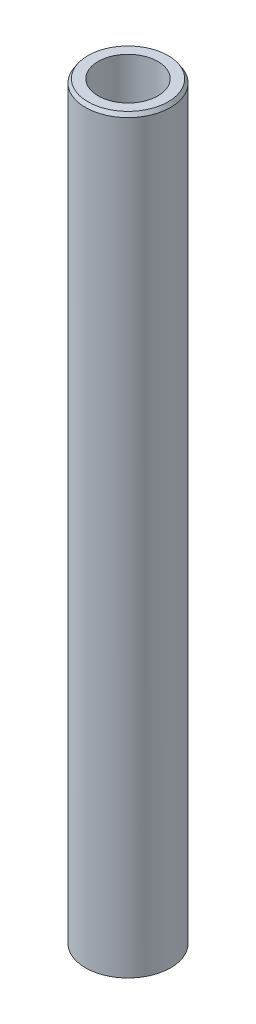
ISO-10303-21;
HEADER;
FILE_DESCRIPTION(('STEP AP214'),'2;1');
FILE_NAME('part.step','',(''),(''),'','','');
FILE_SCHEMA(('AUTOMOTIVE_DESIGN { 1 0 10303 214 1 1 1 1 }'));
ENDSEC;
DATA;
#1=APPLICATION_CONTEXT('core data for automotive mechanical design processes');
#2=APPLICATION_PROTOCOL_DEFINITION('international standard','automotive_design',2000,#1);
#3=PRODUCT_CONTEXT('',#1,'mechanical');
#4=PRODUCT('Part','Part','',(#3));
#5=PRODUCT_RELATED_PRODUCT_CATEGORY('part','',(#4));
#6=PRODUCT_DEFINITION_FORMATION('','',#4);
#7=PRODUCT_DEFINITION_CONTEXT('part definition',#1,'design');
#8=PRODUCT_DEFINITION('design','',#6,#7);
#9=PRODUCT_DEFINITION_SHAPE('','',#8);
#10=(LENGTH_UNIT() NAMED_UNIT(*) SI_UNIT(.MILLI.,.METRE.));
#11=(NAMED_UNIT(*) PLANE_ANGLE_UNIT() SI_UNIT($,.RADIAN.));
#12=(NAMED_UNIT(*) SI_UNIT($,.STERADIAN.) SOLID_ANGLE_UNIT());
#13=UNCERTAINTY_MEASURE_WITH_UNIT(LENGTH_MEASURE(1.E-05),#10,'distance_accuracy_value','');
#14=(GEOMETRIC_REPRESENTATION_CONTEXT(3) GLOBAL_UNCERTAINTY_ASSIGNED_CONTEXT((#13)) GLOBAL_UNIT_ASSIGNED_CONTEXT((#10,
#11,#12)) REPRESENTATION_CONTEXT('',''));
#15=CARTESIAN_POINT('',(0.,0.,0.));
#16=DIRECTION('',(0.,0.,1.));
#17=DIRECTION('',(1.,0.,0.));
#18=AXIS2_PLACEMENT_3D('',#15,#16,#17);
#19=CARTESIAN_POINT('',(0.,441.764951988883,0.));
#20=DIRECTION('',(0.,-1.,0.));
#21=DIRECTION('',(0.,0.,-1.));
#22=AXIS2_PLACEMENT_3D('',#19,#20,#21);
#23=CYLINDRICAL_SURFACE('',#22,25.);
#24=CARTESIAN_POINT('',(0.,439.59367557882,0.));
#25=DIRECTION('',(0.,1.,0.));
#26=DIRECTION('',(0.,0.,1.));
#27=AXIS2_PLACEMENT_3D('',#24,#25,#26);
#28=CIRCLE('',#27,25.);
#29=CARTESIAN_POINT('',(0.,439.59367557882,-25.));
#30=VERTEX_POINT('',#29);
#31=EDGE_CURVE('E50',#30,#30,#28,.F.);
#32=CARTESIAN_POINT('',(0.,1.42944486264962,0.));
#33=DIRECTION('',(0.,1.,0.));
#34=DIRECTION('',(0.,0.,1.));
#35=AXIS2_PLACEMENT_3D('',#32,#33,#34);
#36=CIRCLE('',#35,25.);
#37=CARTESIAN_POINT('',(0.,1.42944486264962,-25.));
#38=VERTEX_POINT('',#37);
#39=EDGE_CURVE('E51',#38,#38,#36,.T.);
#40=CARTESIAN_POINT('',(0.,439.59367557882,-25.));
#41=CARTESIAN_POINT('',(0.,435.029464842194,-25.));
#42=CARTESIAN_POINT('',(0.,430.465254105567,-25.));
#43=CARTESIAN_POINT('',(0.,421.336832632313,-25.));
#44=CARTESIAN_POINT('',(0.,416.772621895687,-25.));
#45=CARTESIAN_POINT('',(0.,407.644200422433,-25.));
#46=CARTESIAN_POINT('',(0.,403.079989685806,-25.));
#47=CARTESIAN_POINT('',(0.,393.951568212553,-25.));
#48=CARTESIAN_POINT('',(0.,389.387357475926,-25.));
#49=CARTESIAN_POINT('',(0.,380.258936002672,-25.));
#50=CARTESIAN_POINT('',(0.,375.694725266046,-25.));
#51=CARTESIAN_POINT('',(0.,366.566303792792,-25.));
#52=CARTESIAN_POINT('',(0.,362.002093056165,-25.));
#53=CARTESIAN_POINT('',(0.,352.873671582912,-25.));
#54=CARTESIAN_POINT('',(0.,348.309460846285,-25.));
#55=CARTESIAN_POINT('',(0.,339.181039373031,-25.));
#56=CARTESIAN_POINT('',(0.,334.616828636405,-25.));
#57=CARTESIAN_POINT('',(0.,325.488407163151,-25.));
#58=CARTESIAN_POINT('',(0.,320.924196426524,-25.));
#59=CARTESIAN_POINT('',(0.,311.795774953271,-25.));
#60=CARTESIAN_POINT('',(0.,307.231564216644,-25.));
#61=CARTESIAN_POINT('',(0.,298.10314274339,-25.));
#62=CARTESIAN_POINT('',(0.,293.538932006764,-25.));
#63=CARTESIAN_POINT('',(0.,284.41051053351,-25.));
#64=CARTESIAN_POINT('',(0.,279.846299796883,-25.));
#65=CARTESIAN_POINT('',(0.,270.71787832363,-25.));
#66=CARTESIAN_POINT('',(0.,266.153667587003,-25.));
#67=CARTESIAN_POINT('',(0.,257.025246113749,-25.));
#68=CARTESIAN_POINT('',(0.,252.461035377122,-25.));
#69=CARTESIAN_POINT('',(0.,243.332613903869,-25.));
#70=CARTESIAN_POINT('',(0.,238.768403167242,-25.));
#71=CARTESIAN_POINT('',(0.,229.639981693989,-25.));
#72=CARTESIAN_POINT('',(0.,225.075770957362,-25.));
#73=CARTESIAN_POINT('',(0.,215.947349484108,-25.));
#74=CARTESIAN_POINT('',(0.,211.383138747481,-25.));
#75=CARTESIAN_POINT('',(0.,202.254717274228,-25.));
#76=CARTESIAN_POINT('',(0.,197.690506537601,-25.));
#77=CARTESIAN_POINT('',(0.,188.562085064348,-25.));
#78=CARTESIAN_POINT('',(0.,183.997874327721,-25.));
#79=CARTESIAN_POINT('',(0.,174.869452854467,-25.));
#80=CARTESIAN_POINT('',(0.,170.30524211784,-25.));
#81=CARTESIAN_POINT('',(0.,161.176820644587,-25.));
#82=CARTESIAN_POINT('',(0.,156.61260990796,-25.));
#83=CARTESIAN_POINT('',(0.,147.484188434707,-25.));
#84=CARTESIAN_POINT('',(0.,142.91997769808,-25.));
#85=CARTESIAN_POINT('',(0.,133.791556224826,-25.));
#86=CARTESIAN_POINT('',(0.,129.227345488199,-25.));
#87=CARTESIAN_POINT('',(0.,120.098924014946,-25.));
#88=CARTESIAN_POINT('',(0.,115.534713278319,-25.));
#89=CARTESIAN_POINT('',(0.,106.406291805066,-25.));
#90=CARTESIAN_POINT('',(0.,101.842081068439,-25.));
#91=CARTESIAN_POINT('',(0.,92.7136595951852,-25.));
#92=CARTESIAN_POINT('',(0.,88.1494488585584,-25.));
#93=CARTESIAN_POINT('',(0.,79.0210273853049,-25.));
#94=CARTESIAN_POINT('',(0.,74.4568166486781,-25.));
#95=CARTESIAN_POINT('',(0.,65.3283951754245,-25.));
#96=CARTESIAN_POINT('',(0.,60.7641844387978,-25.));
#97=CARTESIAN_POINT('',(0.,51.6357629655442,-25.));
#98=CARTESIAN_POINT('',(0.,47.0715522289174,-25.));
#99=CARTESIAN_POINT('',(0.,37.9431307556639,-25.));
#100=CARTESIAN_POINT('',(0.,33.3789200190371,-25.));
#101=CARTESIAN_POINT('',(0.,24.2504985457835,-25.));
#102=CARTESIAN_POINT('',(0.,19.6862878091567,-25.));
#103=CARTESIAN_POINT('',(0.,10.5578663359032,-25.));
#104=CARTESIAN_POINT('',(0.,5.99365559927639,-25.));
#105=CARTESIAN_POINT('',(0.,1.42944486264962,-25.));
#106=B_SPLINE_CURVE_WITH_KNOTS('',3,(#40,#41,#42,#43,#44,#45,#46,#47,#48,#49,#50,#51,#52,#53,
#54,#55,#56,#57,#58,#59,#60,#61,#62,#63,#64,#65,#66,#67,#68,#69,#70,#71,#72,#73,#74,#75,#76,#77,
#78,#79,#80,#81,#82,#83,#84,#85,#86,#87,#88,#89,#90,#91,#92,#93,#94,#95,#96,#97,#98,#99,#100,
#101,#102,#103,#104,#105),.UNSPECIFIED.,.F.,.F.,(4,2,2,2,2,2,2,2,2,2,2,2,2,2,2,2,2,2,2,2,2,2,2,
2,2,2,2,2,2,2,2,2,4),(0.,13.6926322098803,27.3852644197606,41.077896629641,54.7705288395213,
68.4631610494016,82.155793259282,95.8484254691623,109.541057679043,123.233689888923,
136.926322098803,150.618954308684,164.311586518564,178.004218728444,191.696850938325,
205.389483148205,219.082115358085,232.774747567966,246.467379777846,260.160011987726,
273.852644197607,287.545276407487,301.237908617367,314.930540827248,328.623173037128,
342.315805247008,356.008437456889,369.701069666769,383.393701876649,397.08633408653,
410.77896629641,424.47159850629,438.164230716171),.UNSPECIFIED.);
#107=EDGE_CURVE('BSEAM39',#30,#38,#106,.T.);
#108=ORIENTED_EDGE('',*,*,#31,.T.);
#109=ORIENTED_EDGE('',*,*,#39,.T.);
#110=ORIENTED_EDGE('',*,*,#107,.T.);
#111=ORIENTED_EDGE('',*,*,#107,.F.);
#112=EDGE_LOOP('',(#108,#110,#109,#111));
#113=FACE_BOUND('',#112,.T.);
#114=ADVANCED_FACE('F39',(#113),#23,.T.);
#115=CARTESIAN_POINT('',(0.,441.764951988883,0.));
#116=DIRECTION('',(0.,1.,0.));
#117=DIRECTION('',(0.,0.,1.));
#118=AXIS2_PLACEMENT_3D('',#115,#116,#117);
#119=PLANE('',#118);
#120=CARTESIAN_POINT('',(0.,441.764951988883,0.));
#121=DIRECTION('',(0.,1.,0.));
#122=DIRECTION('',(0.,0.,1.));
#123=AXIS2_PLACEMENT_3D('',#120,#121,#122);
#124=CIRCLE('',#123,23.5705551373508);
#125=CARTESIAN_POINT('',(0.,441.764951988883,23.5705551373508));
#126=VERTEX_POINT('',#125);
#127=EDGE_CURVE('E54',#126,#126,#124,.T.);
#128=ORIENTED_EDGE('',*,*,#127,.T.);
#129=EDGE_LOOP('',(#128));
#130=FACE_BOUND('',#129,.T.);
#131=CARTESIAN_POINT('',(0.,441.764951988883,0.));
#132=DIRECTION('',(0.,1.,0.));
#133=DIRECTION('',(0.,0.,1.));
#134=AXIS2_PLACEMENT_3D('',#131,#132,#133);
#135=CIRCLE('',#134,17.5629168309427);
#136=CARTESIAN_POINT('',(0.,441.764951988883,-17.5629168309427));
#137=VERTEX_POINT('',#136);
#138=EDGE_CURVE('E58',#137,#137,#135,.T.);
#139=ORIENTED_EDGE('',*,*,#138,.F.);
#140=EDGE_LOOP('',(#139));
#141=FACE_BOUND('',#140,.T.);
#142=ADVANCED_FACE('F69',(#130,#141),#119,.T.);
#143=CARTESIAN_POINT('',(0.,0.,0.));
#144=DIRECTION('',(0.,1.,0.));
#145=DIRECTION('',(0.,0.,1.));
#146=AXIS2_PLACEMENT_3D('',#143,#144,#145);
#147=PLANE('',#146);
#148=CARTESIAN_POINT('',(0.,0.,0.));
#149=DIRECTION('',(0.,1.,0.));
#150=DIRECTION('',(0.,0.,1.));
#151=AXIS2_PLACEMENT_3D('',#148,#149,#150);
#152=CIRCLE('',#151,22.8287235899367);
#153=CARTESIAN_POINT('',(0.,0.,22.8287235899367));
#154=VERTEX_POINT('',#153);
#155=EDGE_CURVE('E10',#154,#154,#152,.F.);
#156=ORIENTED_EDGE('',*,*,#155,.T.);
#157=EDGE_LOOP('',(#156));
#158=FACE_BOUND('',#157,.T.);
#159=CARTESIAN_POINT('',(0.,0.,0.));
#160=DIRECTION('',(0.,1.,0.));
#161=DIRECTION('',(0.,0.,1.));
#162=AXIS2_PLACEMENT_3D('',#159,#160,#161);
#163=CIRCLE('',#162,17.5629168309427);
#164=CARTESIAN_POINT('',(0.,0.,-17.5629168309427));
#165=VERTEX_POINT('',#164);
#166=EDGE_CURVE('E63',#165,#165,#163,.T.);
#167=ORIENTED_EDGE('',*,*,#166,.T.);
#168=EDGE_LOOP('',(#167));
#169=FACE_BOUND('',#168,.T.);
#170=ADVANCED_FACE('F75',(#158,#169),#147,.F.);
#171=CARTESIAN_POINT('',(0.,441.764951988883,0.));
#172=DIRECTION('',(0.,-1.,0.));
#173=DIRECTION('',(0.,0.,-1.));
#174=AXIS2_PLACEMENT_3D('',#171,#172,#173);
#175=CYLINDRICAL_SURFACE('',#174,17.5629168309427);
#176=CARTESIAN_POINT('',(0.,441.764951988883,-17.5629168309427));
#177=CARTESIAN_POINT('',(0.,437.163233738999,-17.5629168309427));
#178=CARTESIAN_POINT('',(0.,432.561515489115,-17.5629168309427));
#179=CARTESIAN_POINT('',(0.,423.358078989346,-17.5629168309427));
#180=CARTESIAN_POINT('',(0.,418.756360739462,-17.5629168309427));
#181=CARTESIAN_POINT('',(0.,409.552924239694,-17.5629168309427));
#182=CARTESIAN_POINT('',(0.,404.951205989809,-17.5629168309427));
#183=CARTESIAN_POINT('',(0.,395.747769490041,-17.5629168309427));
#184=CARTESIAN_POINT('',(0.,391.146051240157,-17.5629168309427));
#185=CARTESIAN_POINT('',(0.,381.942614740388,-17.5629168309427));
#186=CARTESIAN_POINT('',(0.,377.340896490504,-17.5629168309427));
#187=CARTESIAN_POINT('',(0.,368.137459990736,-17.5629168309427));
#188=CARTESIAN_POINT('',(0.,363.535741740852,-17.5629168309427));
#189=CARTESIAN_POINT('',(0.,354.332305241083,-17.5629168309427));
#190=CARTESIAN_POINT('',(0.,349.730586991199,-17.5629168309427));
#191=CARTESIAN_POINT('',(0.,340.527150491431,-17.5629168309427));
#192=CARTESIAN_POINT('',(0.,335.925432241546,-17.5629168309427));
#193=CARTESIAN_POINT('',(0.,326.721995741778,-17.5629168309427));
#194=CARTESIAN_POINT('',(0.,322.120277491894,-17.5629168309427));
#195=CARTESIAN_POINT('',(0.,312.916840992125,-17.5629168309427));
#196=CARTESIAN_POINT('',(0.,308.315122742241,-17.5629168309427));
#197=CARTESIAN_POINT('',(0.,299.111686242473,-17.5629168309427));
#198=CARTESIAN_POINT('',(0.,294.509967992589,-17.5629168309427));
#199=CARTESIAN_POINT('',(0.,285.30653149282,-17.5629168309427));
#200=CARTESIAN_POINT('',(0.,280.704813242936,-17.5629168309427));
#201=CARTESIAN_POINT('',(0.,271.501376743168,-17.5629168309427));
#202=CARTESIAN_POINT('',(0.,266.899658493283,-17.5629168309427));
#203=CARTESIAN_POINT('',(0.,257.696221993515,-17.5629168309427));
#204=CARTESIAN_POINT('',(0.,253.094503743631,-17.5629168309427));
#205=CARTESIAN_POINT('',(0.,243.891067243862,-17.5629168309427));
#206=CARTESIAN_POINT('',(0.,239.289348993978,-17.5629168309427));
#207=CARTESIAN_POINT('',(0.,230.08591249421,-17.5629168309427));
#208=CARTESIAN_POINT('',(0.,225.484194244326,-17.5629168309427));
#209=CARTESIAN_POINT('',(0.,216.280757744557,-17.5629168309427));
#210=CARTESIAN_POINT('',(0.,211.679039494673,-17.5629168309427));
#211=CARTESIAN_POINT('',(0.,202.475602994905,-17.5629168309427));
#212=CARTESIAN_POINT('',(0.,197.873884745021,-17.5629168309427));
#213=CARTESIAN_POINT('',(0.,188.670448245252,-17.5629168309427));
#214=CARTESIAN_POINT('',(0.,184.068729995368,-17.5629168309427));
#215=CARTESIAN_POINT('',(0.,174.8652934956,-17.5629168309427));
#216=CARTESIAN_POINT('',(0.,170.263575245715,-17.5629168309427));
#217=CARTESIAN_POINT('',(0.,161.060138745947,-17.5629168309427));
#218=CARTESIAN_POINT('',(0.,156.458420496063,-17.5629168309427));
#219=CARTESIAN_POINT('',(0.,147.254983996294,-17.5629168309427));
#220=CARTESIAN_POINT('',(0.,142.65326574641,-17.5629168309427));
#221=CARTESIAN_POINT('',(0.,133.449829246642,-17.5629168309427));
#222=CARTESIAN_POINT('',(0.,128.848110996758,-17.5629168309427));
#223=CARTESIAN_POINT('',(0.,119.644674496989,-17.5629168309427));
#224=CARTESIAN_POINT('',(0.,115.042956247105,-17.5629168309427));
#225=CARTESIAN_POINT('',(0.,105.839519747337,-17.5629168309427));
#226=CARTESIAN_POINT('',(0.,101.237801497452,-17.5629168309427));
#227=CARTESIAN_POINT('',(0.,92.034364997684,-17.5629168309427));
#228=CARTESIAN_POINT('',(0.,87.4326467477998,-17.5629168309427));
#229=CARTESIAN_POINT('',(0.,78.2292102480314,-17.5629168309427));
#230=CARTESIAN_POINT('',(0.,73.6274919981472,-17.5629168309427));
#231=CARTESIAN_POINT('',(0.,64.4240554983788,-17.5629168309427));
#232=CARTESIAN_POINT('',(0.,59.8223372484946,-17.5629168309427));
#233=CARTESIAN_POINT('',(0.,50.6189007487262,-17.5629168309427));
#234=CARTESIAN_POINT('',(0.,46.017182498842,-17.5629168309427));
#235=CARTESIAN_POINT('',(0.,36.8137459990736,-17.5629168309427));
#236=CARTESIAN_POINT('',(0.,32.2120277491894,-17.5629168309427));
#237=CARTESIAN_POINT('',(0.,23.008591249421,-17.5629168309427));
#238=CARTESIAN_POINT('',(0.,18.4068729995368,-17.5629168309427));
#239=CARTESIAN_POINT('',(0.,9.2034364997684,-17.5629168309427));
#240=CARTESIAN_POINT('',(0.,4.6017182498842,-17.5629168309427));
#241=CARTESIAN_POINT('',(0.,0.,-17.5629168309427));
#242=B_SPLINE_CURVE_WITH_KNOTS('',3,(#176,#177,#178,#179,#180,#181,#182,#183,#184,#185,#186,
#187,#188,#189,#190,#191,#192,#193,#194,#195,#196,#197,#198,#199,#200,#201,#202,#203,#204,#205,
#206,#207,#208,#209,#210,#211,#212,#213,#214,#215,#216,#217,#218,#219,#220,#221,#222,#223,#224,
#225,#226,#227,#228,#229,#230,#231,#232,#233,#234,#235,#236,#237,#238,#239,#240,#241),
.UNSPECIFIED.,.F.,.F.,(4,2,2,2,2,2,2,2,2,2,2,2,2,2,2,2,2,2,2,2,2,2,2,2,2,2,2,2,2,2,2,2,4),(0.,
13.8051547496525,27.6103094993052,41.4154642489578,55.2206189986104,69.0257737482629,
82.8309284979155,96.6360832475681,110.441237997221,124.246392746873,138.051547496526,
151.856702246179,165.661856995831,179.467011745484,193.272166495136,207.077321244789,
220.882475994441,234.687630744094,248.492785493747,262.297940243399,276.103094993052,
289.908249742704,303.713404492357,317.51855924201,331.323713991662,345.128868741315,
358.934023490967,372.73917824062,386.544332990273,400.349487739925,414.154642489578,
427.95979723923,441.764951988883),.UNSPECIFIED.);
#243=EDGE_CURVE('BSEAM70',#137,#165,#242,.T.);
#244=ORIENTED_EDGE('',*,*,#138,.T.);
#245=ORIENTED_EDGE('',*,*,#166,.F.);
#246=ORIENTED_EDGE('',*,*,#243,.T.);
#247=ORIENTED_EDGE('',*,*,#243,.F.);
#248=EDGE_LOOP('',(#244,#246,#245,#247));
#249=FACE_BOUND('',#248,.T.);
#250=ADVANCED_FACE('F70',(#249),#175,.F.);
#251=CARTESIAN_POINT('',(0.,441.764951988883,0.));
#252=DIRECTION('',(0.,-1.,0.));
#253=DIRECTION('',(0.,0.,-1.));
#254=AXIS2_PLACEMENT_3D('',#251,#252,#253);
#255=CONICAL_SURFACE('',#254,23.5705551373508,0.582217982490808);
#256=ORIENTED_EDGE('',*,*,#31,.F.);
#257=EDGE_LOOP('',(#256));
#258=FACE_BOUND('',#257,.T.);
#259=ORIENTED_EDGE('',*,*,#127,.F.);
#260=EDGE_LOOP('',(#259));
#261=FACE_BOUND('',#260,.T.);
#262=ADVANCED_FACE('F81',(#258,#261),#255,.T.);
#263=CARTESIAN_POINT('',(0.,1.42944486264962,0.));
#264=DIRECTION('',(0.,1.,0.));
#265=DIRECTION('',(0.,0.,1.));
#266=AXIS2_PLACEMENT_3D('',#263,#264,#265);
#267=CONICAL_SURFACE('',#266,25.,0.988578344304098);
#268=ORIENTED_EDGE('',*,*,#155,.F.);
#269=EDGE_LOOP('',(#268));
#270=FACE_BOUND('',#269,.T.);
#271=ORIENTED_EDGE('',*,*,#39,.F.);
#272=EDGE_LOOP('',(#271));
#273=FACE_BOUND('',#272,.T.);
#274=ADVANCED_FACE('F45',(#270,#273),#267,.T.);
#275=CLOSED_SHELL('',(#114,#142,#170,#250,#262,#274));
#276=MANIFOLD_SOLID_BREP('B2',#275);
#277=ADVANCED_BREP_SHAPE_REPRESENTATION('',(#18,#276),#14);
#278=SHAPE_DEFINITION_REPRESENTATION(#9,#277);
ENDSEC;
END-ISO-10303-21;
